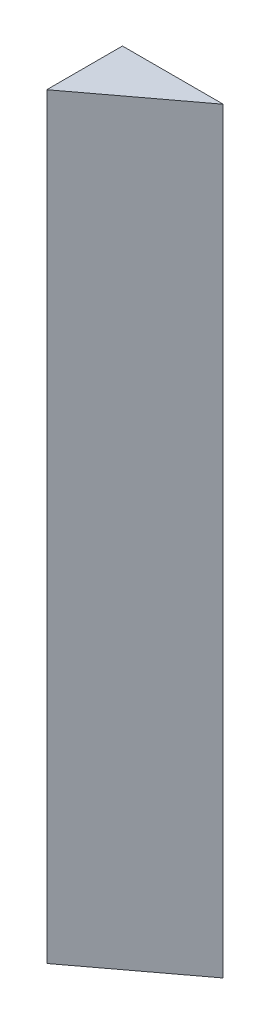
ISO-10303-21;
HEADER;
FILE_DESCRIPTION(('STEP AP214'),'2;1');
FILE_NAME('part.step','',(''),(''),'','','');
FILE_SCHEMA(('AUTOMOTIVE_DESIGN { 1 0 10303 214 1 1 1 1 }'));
ENDSEC;
DATA;
#1=APPLICATION_CONTEXT('core data for automotive mechanical design processes');
#2=APPLICATION_PROTOCOL_DEFINITION('international standard','automotive_design',2000,#1);
#3=PRODUCT_CONTEXT('',#1,'mechanical');
#4=PRODUCT('Part','Part','',(#3));
#5=PRODUCT_RELATED_PRODUCT_CATEGORY('part','',(#4));
#6=PRODUCT_DEFINITION_FORMATION('','',#4);
#7=PRODUCT_DEFINITION_CONTEXT('part definition',#1,'design');
#8=PRODUCT_DEFINITION('design','',#6,#7);
#9=PRODUCT_DEFINITION_SHAPE('','',#8);
#10=(LENGTH_UNIT() NAMED_UNIT(*) SI_UNIT(.MILLI.,.METRE.));
#11=(NAMED_UNIT(*) PLANE_ANGLE_UNIT() SI_UNIT($,.RADIAN.));
#12=(NAMED_UNIT(*) SI_UNIT($,.STERADIAN.) SOLID_ANGLE_UNIT());
#13=UNCERTAINTY_MEASURE_WITH_UNIT(LENGTH_MEASURE(1.E-05),#10,'distance_accuracy_value','');
#14=(GEOMETRIC_REPRESENTATION_CONTEXT(3) GLOBAL_UNCERTAINTY_ASSIGNED_CONTEXT((#13)) GLOBAL_UNIT_ASSIGNED_CONTEXT((#10,
#11,#12)) REPRESENTATION_CONTEXT('',''));
#15=CARTESIAN_POINT('',(0.,0.,0.));
#16=DIRECTION('',(0.,0.,1.));
#17=DIRECTION('',(1.,0.,0.));
#18=AXIS2_PLACEMENT_3D('',#15,#16,#17);
#19=CARTESIAN_POINT('',(-3.90666080275233,1.75000038640621,-2.35778247673823));
#20=DIRECTION('',(-1.74845553146952E-07,-1.,-8.74227765734759E-08));
#21=DIRECTION('',(1.,-1.74845553146952E-07,0.));
#22=AXIS2_PLACEMENT_3D('',#19,#20,#21);
#23=PLANE('',#22);
#24=DIRECTION('',(0.999999999999985,-1.74845553322983E-07,0.));
#25=VECTOR('',#24,1.);
#26=CARTESIAN_POINT('',(-3.89999969402033,1.75000038465922,-2.35112136800623));
#27=LINE('',#26,#25);
#28=CARTESIAN_POINT('',(-3.89999969402033,1.75000038465822,-2.35112136800623));
#29=VERTEX_POINT('',#28);
#30=CARTESIAN_POINT('',(-3.76677751937633,1.75000036136491,-2.35112136800623));
#31=VERTEX_POINT('',#30);
#32=EDGE_CURVE('E11',#29,#31,#27,.T.);
#33=ORIENTED_EDGE('',*,*,#32,.F.);
#34=DIRECTION('',(0.,8.74227756852974E-08,-0.999999999999996));
#35=VECTOR('',#34,1.);
#36=CARTESIAN_POINT('',(-3.89999969402034,1.75000037591694,-2.25112136800623));
#37=LINE('',#36,#35);
#38=CARTESIAN_POINT('',(-3.89999969402034,1.75000037591594,-2.25112136800623));
#39=VERTEX_POINT('',#38);
#40=EDGE_CURVE('E63',#39,#29,#37,.T.);
#41=ORIENTED_EDGE('',*,*,#40,.F.);
#42=DIRECTION('',(-0.799759704949037,8.73527633914448E-08,0.600320259811229));
#43=VECTOR('',#42,1.);
#44=CARTESIAN_POINT('',(-3.76677751937633,1.75000036136591,-2.35112136800623));
#45=LINE('',#44,#43);
#46=EDGE_CURVE('E70',#31,#39,#45,.T.);
#47=ORIENTED_EDGE('',*,*,#46,.F.);
#48=EDGE_LOOP('',(#33,#41,#47));
#49=FACE_BOUND('',#48,.T.);
#50=ADVANCED_FACE('F17',(#49),#23,.F.);
#51=CARTESIAN_POINT('',(-3.90666097759789,0.750000386406215,-2.35778256416101));
#52=DIRECTION('',(-1.74845553146952E-07,-1.,-8.74227765734759E-08));
#53=DIRECTION('',(1.,-1.74845553146952E-07,0.));
#54=AXIS2_PLACEMENT_3D('',#51,#52,#53);
#55=PLANE('',#54);
#56=DIRECTION('',(-0.799759704949039,8.73527640579338E-08,0.600320259811226));
#57=VECTOR('',#56,1.);
#58=CARTESIAN_POINT('',(-3.76677769422189,0.750000361365912,-2.35112145542901));
#59=LINE('',#58,#57);
#60=CARTESIAN_POINT('',(-3.76677769422189,0.750000361366912,-2.35112145542901));
#61=VERTEX_POINT('',#60);
#62=CARTESIAN_POINT('',(-3.89999986886589,0.750000375917939,-2.25112145542901));
#63=VERTEX_POINT('',#62);
#64=EDGE_CURVE('E24',#61,#63,#59,.T.);
#65=ORIENTED_EDGE('',*,*,#64,.T.);
#66=DIRECTION('',(0.,8.74227767955201E-08,-0.999999999999996));
#67=VECTOR('',#66,1.);
#68=CARTESIAN_POINT('',(-3.89999986886589,0.750000375916939,-2.25112145542901));
#69=LINE('',#68,#67);
#70=CARTESIAN_POINT('',(-3.89999986886589,0.750000384660217,-2.35112145542901));
#71=VERTEX_POINT('',#70);
#72=EDGE_CURVE('E49',#63,#71,#69,.T.);
#73=ORIENTED_EDGE('',*,*,#72,.T.);
#74=DIRECTION('',(0.999999999999985,-1.74845553322983E-07,0.));
#75=VECTOR('',#74,1.);
#76=CARTESIAN_POINT('',(-3.89999986886589,0.750000384659217,-2.35112145542901));
#77=LINE('',#76,#75);
#78=EDGE_CURVE('E46',#71,#61,#77,.T.);
#79=ORIENTED_EDGE('',*,*,#78,.T.);
#80=EDGE_LOOP('',(#65,#73,#79));
#81=FACE_BOUND('',#80,.T.);
#82=ADVANCED_FACE('F47',(#81),#55,.T.);
#83=CARTESIAN_POINT('',(-3.76677751937633,1.75000036136591,-2.35112136800623));
#84=DIRECTION('',(0.600320259811223,-1.74880541890246E-07,0.799759704949038));
#85=DIRECTION('',(-0.799759704949047,8.73527640504488E-08,0.600320259811235));
#86=AXIS2_PLACEMENT_3D('',#83,#84,#85);
#87=PLANE('',#86);
#88=ORIENTED_EDGE('',*,*,#46,.T.);
#89=DIRECTION('',(-1.74845553146948E-07,-0.999999999999981,-8.74227765734742E-08));
#90=VECTOR('',#89,1.);
#91=CARTESIAN_POINT('',(-3.89999969402034,1.75000037591694,-2.25112136800623));
#92=LINE('',#91,#90);
#93=EDGE_CURVE('E54',#39,#63,#92,.T.);
#94=ORIENTED_EDGE('',*,*,#93,.T.);
#95=ORIENTED_EDGE('',*,*,#64,.F.);
#96=DIRECTION('',(-1.74845553146948E-07,-0.999999999999981,-8.74227765734742E-08));
#97=VECTOR('',#96,1.);
#98=CARTESIAN_POINT('',(-3.76677751937633,1.75000036136591,-2.35112136800623));
#99=LINE('',#98,#97);
#100=EDGE_CURVE('E61',#31,#61,#99,.T.);
#101=ORIENTED_EDGE('',*,*,#100,.F.);
#102=EDGE_LOOP('',(#88,#94,#95,#101));
#103=FACE_BOUND('',#102,.T.);
#104=ADVANCED_FACE('F60',(#103),#87,.T.);
#105=CARTESIAN_POINT('',(-3.89999969402034,1.75000037591694,-2.25112136800623));
#106=DIRECTION('',(-1.,1.74845553146952E-07,0.));
#107=DIRECTION('',(0.,8.74227765734759E-08,-1.));
#108=AXIS2_PLACEMENT_3D('',#105,#106,#107);
#109=PLANE('',#108);
#110=ORIENTED_EDGE('',*,*,#40,.T.);
#111=DIRECTION('',(-1.74845553146948E-07,-0.999999999999981,-8.74227765734742E-08));
#112=VECTOR('',#111,1.);
#113=CARTESIAN_POINT('',(-3.89999969402033,1.75000038465922,-2.35112136800623));
#114=LINE('',#113,#112);
#115=EDGE_CURVE('E55',#29,#71,#114,.T.);
#116=ORIENTED_EDGE('',*,*,#115,.T.);
#117=ORIENTED_EDGE('',*,*,#72,.F.);
#118=ORIENTED_EDGE('',*,*,#93,.F.);
#119=EDGE_LOOP('',(#110,#116,#117,#118));
#120=FACE_BOUND('',#119,.T.);
#121=ADVANCED_FACE('F73',(#120),#109,.T.);
#122=CARTESIAN_POINT('',(-3.89999969402033,1.75000038465922,-2.35112136800623));
#123=DIRECTION('',(0.,8.74227765734759E-08,-1.));
#124=DIRECTION('',(1.,-1.74845553146952E-07,0.));
#125=AXIS2_PLACEMENT_3D('',#122,#123,#124);
#126=PLANE('',#125);
#127=ORIENTED_EDGE('',*,*,#32,.T.);
#128=ORIENTED_EDGE('',*,*,#100,.T.);
#129=ORIENTED_EDGE('',*,*,#78,.F.);
#130=ORIENTED_EDGE('',*,*,#115,.F.);
#131=EDGE_LOOP('',(#127,#128,#129,#130));
#132=FACE_BOUND('',#131,.T.);
#133=ADVANCED_FACE('F64',(#132),#126,.T.);
#134=CLOSED_SHELL('',(#50,#82,#104,#121,#133));
#135=MANIFOLD_SOLID_BREP('B1',#134);
#136=ADVANCED_BREP_SHAPE_REPRESENTATION('',(#18,#135),#14);
#137=SHAPE_DEFINITION_REPRESENTATION(#9,#136);
ENDSEC;
END-ISO-10303-21;
